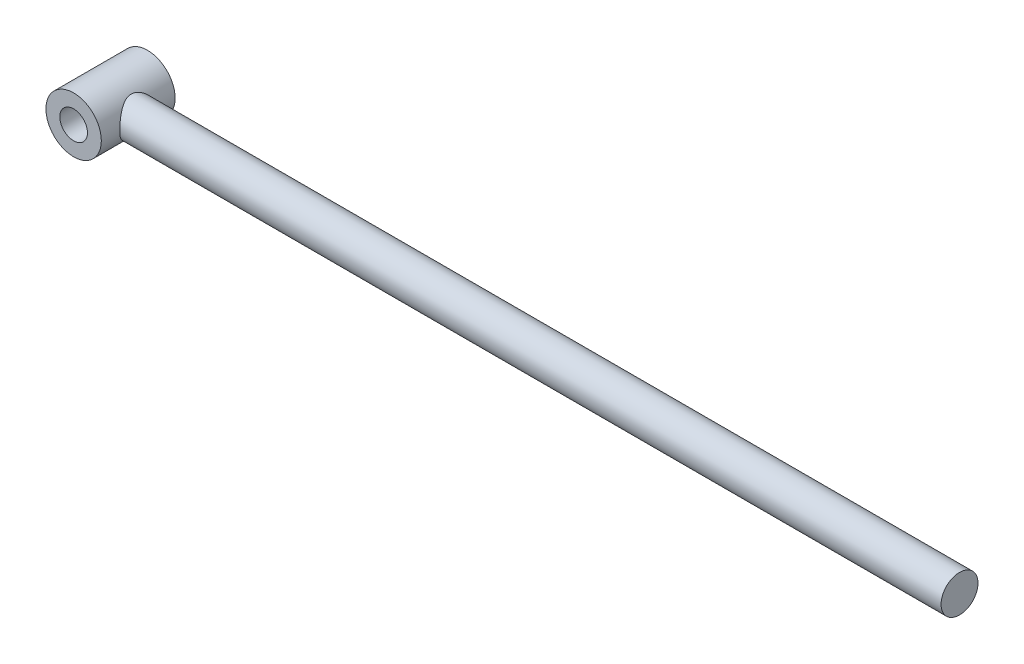
ISO-10303-21;
HEADER;
FILE_DESCRIPTION(('STEP AP214'),'2;1');
FILE_NAME('part.step','',(''),(''),'','','');
FILE_SCHEMA(('AUTOMOTIVE_DESIGN { 1 0 10303 214 1 1 1 1 }'));
ENDSEC;
DATA;
#1=APPLICATION_CONTEXT('core data for automotive mechanical design processes');
#2=APPLICATION_PROTOCOL_DEFINITION('international standard','automotive_design',2000,#1);
#3=PRODUCT_CONTEXT('',#1,'mechanical');
#4=PRODUCT('Part','Part','',(#3));
#5=PRODUCT_RELATED_PRODUCT_CATEGORY('part','',(#4));
#6=PRODUCT_DEFINITION_FORMATION('','',#4);
#7=PRODUCT_DEFINITION_CONTEXT('part definition',#1,'design');
#8=PRODUCT_DEFINITION('design','',#6,#7);
#9=PRODUCT_DEFINITION_SHAPE('','',#8);
#10=(LENGTH_UNIT() NAMED_UNIT(*) SI_UNIT(.MILLI.,.METRE.));
#11=(NAMED_UNIT(*) PLANE_ANGLE_UNIT() SI_UNIT($,.RADIAN.));
#12=(NAMED_UNIT(*) SI_UNIT($,.STERADIAN.) SOLID_ANGLE_UNIT());
#13=UNCERTAINTY_MEASURE_WITH_UNIT(LENGTH_MEASURE(1.E-05),#10,'distance_accuracy_value','');
#14=(GEOMETRIC_REPRESENTATION_CONTEXT(3) GLOBAL_UNCERTAINTY_ASSIGNED_CONTEXT((#13)) GLOBAL_UNIT_ASSIGNED_CONTEXT((#10,
#11,#12)) REPRESENTATION_CONTEXT('',''));
#15=CARTESIAN_POINT('',(0.,0.,0.));
#16=DIRECTION('',(0.,0.,1.));
#17=DIRECTION('',(1.,0.,0.));
#18=AXIS2_PLACEMENT_3D('',#15,#16,#17);
#19=CARTESIAN_POINT('',(0.,0.,40.));
#20=DIRECTION('',(0.,0.,-1.));
#21=DIRECTION('',(-1.,0.,0.));
#22=AXIS2_PLACEMENT_3D('',#19,#20,#21);
#23=CYLINDRICAL_SURFACE('',#22,30.);
#24=CARTESIAN_POINT('',(0.,0.,40.));
#25=DIRECTION('',(0.,0.,1.));
#26=DIRECTION('',(1.,0.,0.));
#27=AXIS2_PLACEMENT_3D('',#24,#25,#26);
#28=CIRCLE('',#27,30.);
#29=CARTESIAN_POINT('',(30.,0.,40.));
#30=VERTEX_POINT('',#29);
#31=EDGE_CURVE('E49',#30,#30,#28,.T.);
#32=ORIENTED_EDGE('',*,*,#31,.F.);
#33=EDGE_LOOP('',(#32));
#34=FACE_BOUND('',#33,.T.);
#35=CARTESIAN_POINT('',(0.,0.,-40.));
#36=DIRECTION('',(0.,0.,1.));
#37=DIRECTION('',(1.,0.,0.));
#38=AXIS2_PLACEMENT_3D('',#35,#36,#37);
#39=CIRCLE('',#38,30.);
#40=CARTESIAN_POINT('',(30.,0.,-40.));
#41=VERTEX_POINT('',#40);
#42=EDGE_CURVE('E54',#41,#41,#39,.T.);
#43=ORIENTED_EDGE('',*,*,#42,.T.);
#44=EDGE_LOOP('',(#43));
#45=FACE_BOUND('',#44,.T.);
#46=CARTESIAN_POINT('',(30.,0.,20.));
#47=CARTESIAN_POINT('',(29.9999998661981,-0.502432050357107,19.9999998708156));
#48=CARTESIAN_POINT('',(29.9873512767924,-1.00486659291617,19.981041890221));
#49=CARTESIAN_POINT('',(29.9370754507124,-2.00562861223446,19.9055087079442));
#50=CARTESIAN_POINT('',(29.8994480825663,-2.50395606736271,19.8489333082686));
#51=CARTESIAN_POINT('',(29.8001252135495,-3.49278874290095,19.6990002879968));
#52=CARTESIAN_POINT('',(29.7384203306489,-3.98329083644028,19.6056283291341));
#53=CARTESIAN_POINT('',(29.5924098661005,-4.9527367018995,19.3834395211629));
#54=CARTESIAN_POINT('',(29.5081040111715,-5.43168033398314,19.2546222434644));
#55=CARTESIAN_POINT('',(29.3192451350848,-6.3726831529905,18.9639204802124));
#56=CARTESIAN_POINT('',(29.2147907649452,-6.83481207132658,18.8021969068242));
#57=CARTESIAN_POINT('',(28.987567335659,-7.74207070686117,18.4471586375469));
#58=CARTESIAN_POINT('',(28.864798371266,-8.18720051199242,18.2538441050984));
#59=CARTESIAN_POINT('',(28.6033482003015,-9.05844037609498,17.8375381124749));
#60=CARTESIAN_POINT('',(28.4646675126729,-9.48455105472426,17.6145476201097));
#61=CARTESIAN_POINT('',(28.1739113247129,-10.3162415378409,17.1407197895657));
#62=CARTESIAN_POINT('',(28.0218342454824,-10.7218189133778,16.88987916806));
#63=CARTESIAN_POINT('',(27.6935578417576,-11.544666651525,16.3397046695659));
#64=CARTESIAN_POINT('',(27.5164065024113,-11.9600134544702,16.0380625153589));
#65=CARTESIAN_POINT('',(27.1528656210948,-12.7638755092378,15.4060039283267));
#66=CARTESIAN_POINT('',(26.9664756598522,-13.1523895414017,15.0755861890756));
#67=CARTESIAN_POINT('',(26.5877396332004,-13.9021114634373,14.3871695519229));
#68=CARTESIAN_POINT('',(26.3953859507486,-14.2632822184454,14.0291344326562));
#69=CARTESIAN_POINT('',(26.0086530551827,-14.9568597365416,13.2872215493219));
#70=CARTESIAN_POINT('',(25.8142737230126,-15.2892647981446,12.9033422589614));
#71=CARTESIAN_POINT('',(25.396836648899,-15.9745417178036,12.0482275933553));
#72=CARTESIAN_POINT('',(25.174096536266,-16.3223586443349,11.5727693191127));
#73=CARTESIAN_POINT('',(24.7376939344548,-16.9764877633748,10.5899657994356));
#74=CARTESIAN_POINT('',(24.5240335140448,-17.2827905315006,10.0826133516483));
#75=CARTESIAN_POINT('',(24.1134541975624,-17.8511644026812,9.03819236671138));
#76=CARTESIAN_POINT('',(23.9165127661255,-18.1132955295477,8.50116549380746));
#77=CARTESIAN_POINT('',(23.5472211433069,-18.5908454263022,7.39870988362545));
#78=CARTESIAN_POINT('',(23.3748591544978,-18.8062866319954,6.83329494920044));
#79=CARTESIAN_POINT('',(23.1083554699939,-19.13202887715,5.84404921175392));
#80=CARTESIAN_POINT('',(23.0059988256492,-19.254726201792,5.42648017350507));
#81=CARTESIAN_POINT('',(22.8211903176783,-19.4734126020971,4.58008091505703));
#82=CARTESIAN_POINT('',(22.7387352052499,-19.5694060373963,4.15125254556424));
#83=CARTESIAN_POINT('',(22.5966842761104,-19.7332623242764,3.28516192271634));
#84=CARTESIAN_POINT('',(22.5370547106277,-19.8011667190628,2.84791313270976));
#85=CARTESIAN_POINT('',(22.442775186748,-19.9079619855319,1.96717747103349));
#86=CARTESIAN_POINT('',(22.4081253652476,-19.9468526982109,1.5236905651906));
#87=CARTESIAN_POINT('',(22.3651578047493,-19.995018995311,0.631973802665962));
#88=CARTESIAN_POINT('',(22.3569497015249,-20.0041712760879,0.183731910267435));
#89=CARTESIAN_POINT('',(22.3675301691013,-19.9923398271623,-0.712030658740458));
#90=CARTESIAN_POINT('',(22.3863188316053,-19.971355995093,-1.15955133289481));
#91=CARTESIAN_POINT('',(22.4501086857203,-19.8996205096492,-2.050625095392));
#92=CARTESIAN_POINT('',(22.4951293541334,-19.8488467375743,-2.49417498677212));
#93=CARTESIAN_POINT('',(22.6095581655225,-19.7184018881212,-3.37377492739303));
#94=CARTESIAN_POINT('',(22.6789667736164,-19.6387302596127,-3.80982483343045));
#95=CARTESIAN_POINT('',(22.8360020403641,-19.4558684710411,-4.65260599507371));
#96=CARTESIAN_POINT('',(22.9226794986437,-19.3538839737256,-5.05977803330656));
#97=CARTESIAN_POINT('',(23.1133089528256,-19.1258219416928,-5.86323587316174));
#98=CARTESIAN_POINT('',(23.2172676308142,-18.9997350845369,-6.25951739443491));
#99=CARTESIAN_POINT('',(23.5509005263236,-18.5870898788947,-7.42993067111853));
#100=CARTESIAN_POINT('',(23.8024209013306,-18.2660472919538,-8.18608179416508));
#101=CARTESIAN_POINT('',(24.2342569329526,-17.6854431992285,-9.35228726673066));
#102=CARTESIAN_POINT('',(24.403077317783,-17.4522559964646,-9.78032481496439));
#103=CARTESIAN_POINT('',(24.7497432705651,-16.9570483876589,-10.6157476442302));
#104=CARTESIAN_POINT('',(24.9275896995493,-16.6950252280375,-11.023130947529));
#105=CARTESIAN_POINT('',(25.2885468949722,-16.1430567151301,-11.8167546644321));
#106=CARTESIAN_POINT('',(25.471663237886,-15.8530809594392,-12.2029713238621));
#107=CARTESIAN_POINT('',(25.8393965051977,-15.246358714758,-12.9530389311317));
#108=CARTESIAN_POINT('',(26.024013528533,-14.9296104475491,-13.3168883905748));
#109=CARTESIAN_POINT('',(26.4310497738324,-14.1989483888887,-14.097303197129));
#110=CARTESIAN_POINT('',(26.6530303956695,-13.7788159652825,-14.5083033678111));
#111=CARTESIAN_POINT('',(27.0885965336176,-12.9014676729698,-15.2937513429522));
#112=CARTESIAN_POINT('',(27.3021805000215,-12.4442450060576,-15.6681924187186));
#113=CARTESIAN_POINT('',(27.7153401348638,-11.4946861176089,-16.3775183221479));
#114=CARTESIAN_POINT('',(27.9149260225621,-11.0023760522687,-16.7124321311584));
#115=CARTESIAN_POINT('',(28.2949676279155,-9.98447354240779,-17.3397652164747));
#116=CARTESIAN_POINT('',(28.4754286055529,-9.45889031296221,-17.6321961852127));
#117=CARTESIAN_POINT('',(28.7791644068812,-8.4833461227497,-18.1181905483136));
#118=CARTESIAN_POINT('',(28.9067147978732,-8.03875717640116,-18.3198975753372));
#119=CARTESIAN_POINT('',(29.1437173052015,-7.13185034835575,-18.691623162803));
#120=CARTESIAN_POINT('',(29.2531715370476,-6.66953454679109,-18.8616454276103));
#121=CARTESIAN_POINT('',(29.4516277514227,-5.7299227277189,-19.1679937956703));
#122=CARTESIAN_POINT('',(29.5406434674396,-5.25263701566193,-19.3043425302522));
#123=CARTESIAN_POINT('',(29.6963305492252,-4.28575432400347,-19.5417523912564));
#124=CARTESIAN_POINT('',(29.7630015712691,-3.79615715514135,-19.6428129748477));
#125=CARTESIAN_POINT('',(29.872657894971,-2.80597314349125,-19.8085733139663));
#126=CARTESIAN_POINT('',(29.9155383206477,-2.30534759903096,-19.8731120951364));
#127=CARTESIAN_POINT('',(29.9760956021539,-1.29911991465958,-19.9641545523483));
#128=CARTESIAN_POINT('',(29.9937724250504,-0.793517768246534,-19.9906581786905));
#129=CARTESIAN_POINT('',(30.0034717951189,0.218464736427053,-20.0052080328604));
#130=CARTESIAN_POINT('',(29.9954953996663,0.724845061752678,-19.9932558457617));
#131=CARTESIAN_POINT('',(29.9540933231667,1.73418156784465,-19.931087455494));
#132=CARTESIAN_POINT('',(29.9206687283027,2.23713789383013,-19.8808728854445));
#133=CARTESIAN_POINT('',(29.8324414506934,3.20042176411033,-19.7478312691314));
#134=CARTESIAN_POINT('',(29.7793090042603,3.66125811656818,-19.6675483452082));
#135=CARTESIAN_POINT('',(29.6529106481444,4.57350157570509,-19.4756341111471));
#136=CARTESIAN_POINT('',(29.5796458717002,5.02490921158323,-19.3640045654864));
#137=CARTESIAN_POINT('',(29.4144446665676,5.91571607198156,-19.1106977521881));
#138=CARTESIAN_POINT('',(29.3225070223762,6.35511451265425,-18.9690185284518));
#139=CARTESIAN_POINT('',(29.1217004947068,7.21966385402625,-18.6571079304231));
#140=CARTESIAN_POINT('',(29.0128307093883,7.64481399436505,-18.486875035266));
#141=CARTESIAN_POINT('',(28.7730488442419,8.50426678457443,-18.1083152340667));
#142=CARTESIAN_POINT('',(28.641201691667,8.93756698372232,-17.8983067263232));
#143=CARTESIAN_POINT('',(28.3631030211141,9.78432512725706,-17.449829798643));
#144=CARTESIAN_POINT('',(28.2168510697156,10.1977824740429,-17.2113605223154));
#145=CARTESIAN_POINT('',(27.9124418593605,11.0036909497809,-16.7076242018634));
#146=CARTESIAN_POINT('',(27.7542793038351,11.3961325988641,-16.4423452174859));
#147=CARTESIAN_POINT('',(27.4287361682711,12.1587990167243,-15.8866695617355));
#148=CARTESIAN_POINT('',(27.2613545613898,12.5290213010131,-15.5962700903114));
#149=CARTESIAN_POINT('',(26.8930879740092,13.3031347178692,-14.9439528947196));
#150=CARTESIAN_POINT('',(26.6910905163229,13.7030923841241,-14.5779874749765));
#151=CARTESIAN_POINT('',(26.2826982946006,14.4709683638239,-13.8160664974289));
#152=CARTESIAN_POINT('',(26.0763029510259,14.8388824217615,-13.4201069693141));
#153=CARTESIAN_POINT('',(25.6635739697582,15.5417880165119,-12.5994023240134));
#154=CARTESIAN_POINT('',(25.4572404691787,15.876757023597,-12.174637839138));
#155=CARTESIAN_POINT('',(25.0497261492331,16.5122275702686,-11.2977646153286));
#156=CARTESIAN_POINT('',(24.8485448051984,16.81273263041,-10.8456586765927));
#157=CARTESIAN_POINT('',(24.4733023029991,17.3538627139578,-9.95448274755281));
#158=CARTESIAN_POINT('',(24.2983863656877,17.5974024349064,-9.51754297050518));
#159=CARTESIAN_POINT('',(23.9619407246742,18.0528546349536,-8.62244520074572));
#160=CARTESIAN_POINT('',(23.8004112149102,18.2647666558762,-8.16428690077693));
#161=CARTESIAN_POINT('',(23.4959190621918,18.6548371117046,-7.22866142786252));
#162=CARTESIAN_POINT('',(23.352929353255,18.8330449293941,-6.75122376801286));
#163=CARTESIAN_POINT('',(23.0904591353035,19.1539484457238,-5.77827480129949));
#164=CARTESIAN_POINT('',(22.9709732247938,19.2966523056608,-5.28276767814733));
#165=CARTESIAN_POINT('',(22.7795445121487,19.5220414226083,-4.36698264384053));
#166=CARTESIAN_POINT('',(22.7029160837044,19.6109049179647,-3.94920001271946));
#167=CARTESIAN_POINT('',(22.5714513943609,19.7620762933325,-3.1054686934564));
#168=CARTESIAN_POINT('',(22.5166125085731,19.82438737206,-2.6795209954077));
#169=CARTESIAN_POINT('',(22.4307802243878,19.9214537495162,-1.8224911908299));
#170=CARTESIAN_POINT('',(22.3997648547817,19.9562344390175,-1.39141418836717));
#171=CARTESIAN_POINT('',(22.3627151772862,19.9977438544737,-0.526818989046352));
#172=CARTESIAN_POINT('',(22.3566812339737,20.0044721710347,-0.093300756653625));
#173=CARTESIAN_POINT('',(22.3698449862022,19.9897505651309,0.773115287328889));
#174=CARTESIAN_POINT('',(22.3890570855061,19.9682845568072,1.20601260355544));
#175=CARTESIAN_POINT('',(22.4519644396444,19.89752521375,2.06770261584204));
#176=CARTESIAN_POINT('',(22.4956594937704,19.8482321071399,2.49649534552171));
#177=CARTESIAN_POINT('',(22.6059284972836,19.7225495457303,3.34758196945676));
#178=CARTESIAN_POINT('',(22.672528474229,19.6461292623078,3.76986789699179));
#179=CARTESIAN_POINT('',(22.8262602119977,19.4672984586528,4.60508117377623));
#180=CARTESIAN_POINT('',(22.9133946099072,19.3648846001243,5.01800731354381));
#181=CARTESIAN_POINT('',(23.1310818906606,19.1046848410163,5.94123169432083));
#182=CARTESIAN_POINT('',(23.2670175183132,18.9394160062732,6.44816076864198));
#183=CARTESIAN_POINT('',(23.5616278122302,18.5716220555323,7.44147650640459));
#184=CARTESIAN_POINT('',(23.7203087439171,18.3690866697139,7.92785746170607));
#185=CARTESIAN_POINT('',(24.0548494900776,17.928768029319,8.87885978411792));
#186=CARTESIAN_POINT('',(24.230727597647,17.6909470983741,9.34345718517344));
#187=CARTESIAN_POINT('',(24.5941802563021,17.1820850766219,10.2491849776676));
#188=CARTESIAN_POINT('',(24.781754189423,16.9110457402246,10.6903166066737));
#189=CARTESIAN_POINT('',(25.1672255632098,16.3319905343255,11.5560455039427));
#190=CARTESIAN_POINT('',(25.3652486390898,16.0233924051234,11.9801968484712));
#191=CARTESIAN_POINT('',(25.7637225763061,15.3745104302451,12.8022908705141));
#192=CARTESIAN_POINT('',(25.9641734317233,15.0342266618099,13.200233611914));
#193=CARTESIAN_POINT('',(26.3632502502894,14.3228973596636,13.9688530344093));
#194=CARTESIAN_POINT('',(26.5618756733661,13.951843028237,14.33952185996));
#195=CARTESIAN_POINT('',(26.9531887772778,13.180017889376,15.0520096270216));
#196=CARTESIAN_POINT('',(27.1458759630328,12.779244613665,15.3938261671826));
#197=CARTESIAN_POINT('',(27.5484327444244,11.8892953412499,16.0937728405199));
#198=CARTESIAN_POINT('',(27.7567878541469,11.3956949938791,16.4471788212645));
#199=CARTESIAN_POINT('',(28.1549839321458,10.372947033489,17.1106254017982));
#200=CARTESIAN_POINT('',(28.3448221999976,9.84379425458726,17.42065967928));
#201=CARTESIAN_POINT('',(28.7002669540513,8.7534583378163,17.9932104380746));
#202=CARTESIAN_POINT('',(28.8659031307225,8.19231563994947,18.2557852367735));
#203=CARTESIAN_POINT('',(29.1680076078479,7.04137086874954,18.7298173077689));
#204=CARTESIAN_POINT('',(29.3044861493112,6.45157894748342,18.9412925311521));
#205=CARTESIAN_POINT('',(29.5171038312658,5.38222751658728,19.2683981125324));
#206=CARTESIAN_POINT('',(29.5999120726272,4.90728446450014,19.3948839484347));
#207=CARTESIAN_POINT('',(29.7432935523992,3.94618639128292,19.6130133782002));
#208=CARTESIAN_POINT('',(29.8038703786017,3.46003319276103,19.7046625942176));
#209=CARTESIAN_POINT('',(29.9013488891663,2.48023551916962,19.8517933612465));
#210=CARTESIAN_POINT('',(29.9382651667603,1.98659585428405,19.9072972061548));
#211=CARTESIAN_POINT('',(29.9875912480541,0.995305041117371,19.9814012816267));
#212=CARTESIAN_POINT('',(30.0000001325294,0.497653743070644,20.0000001279558));
#213=CARTESIAN_POINT('',(30.,0.,20.));
#214=B_SPLINE_CURVE_WITH_KNOTS('',3,(#46,#47,#48,#49,#50,#51,#52,#53,#54,#55,#56,#57,#58,#59,
#60,#61,#62,#63,#64,#65,#66,#67,#68,#69,#70,#71,#72,#73,#74,#75,#76,#77,#78,#79,#80,#81,#82,#83,
#84,#85,#86,#87,#88,#89,#90,#91,#92,#93,#94,#95,#96,#97,#98,#99,#100,#101,#102,#103,#104,#105,
#106,#107,#108,#109,#110,#111,#112,#113,#114,#115,#116,#117,#118,#119,#120,#121,#122,#123,#124,
#125,#126,#127,#128,#129,#130,#131,#132,#133,#134,#135,#136,#137,#138,#139,#140,#141,#142,#143,
#144,#145,#146,#147,#148,#149,#150,#151,#152,#153,#154,#155,#156,#157,#158,#159,#160,#161,#162,
#163,#164,#165,#166,#167,#168,#169,#170,#171,#172,#173,#174,#175,#176,#177,#178,#179,#180,#181,
#182,#183,#184,#185,#186,#187,#188,#189,#190,#191,#192,#193,#194,#195,#196,#197,#198,#199,#200,
#201,#202,#203,#204,#205,#206,#207,#208,#209,#210,#211,#212,#213),.UNSPECIFIED.,.T.,.F.,(4,2,2,
2,2,2,2,2,2,2,2,2,2,2,2,2,2,2,2,2,2,2,2,2,2,2,2,2,2,2,2,2,2,2,2,2,2,2,2,2,2,2,2,2,2,2,2,2,2,2,2,
2,2,2,2,2,2,2,2,2,2,2,2,2,2,2,2,2,2,2,2,2,2,2,2,2,2,2,2,2,2,2,2,4),(0.,1.50678860030269,
3.01358513141216,4.52096938721657,6.02837187047945,7.52857302893605,9.02876642612416,
10.5289109101103,12.0292324383504,13.6567444840869,15.284330458243,16.9140886133164,
18.5439431024577,20.431131930561,22.3187484658921,24.2037789087041,26.0879015235946,
27.4279650999174,28.7678097709498,30.1056656880386,31.4435289369311,32.7869323000986,
34.1303402265693,35.4747468830929,36.8191791810432,38.1037263431644,39.3887713582513,
41.9574635192448,43.5039572638651,45.0505988133526,46.5989419535985,48.1473880150574,
50.0299431140749,51.9128440463346,53.7943557465543,55.6753486185392,57.1876211138398,
58.6997166935429,60.2107932404063,61.7218930308516,63.2396023156496,64.7573135836025,
66.2749622952646,67.7925462340977,69.2033177886316,70.6140099478306,72.0247939649324,
73.4356531490233,74.9318700392892,76.4281319624119,77.9250632379934,79.4221615843148,
81.1559974776003,82.8900632805819,84.6253068106235,86.3603729242013,87.9487273830719,
89.5371048494666,91.1231367124568,92.7088036566569,94.0093258243475,95.3096912764256,
96.6088560233589,97.9080397301251,99.2079649891922,100.507879591774,101.809276234171,
103.110840096639,104.759184673476,106.407984179069,108.058557042328,109.70904276911,
111.389510486189,113.069974106853,114.750919862111,116.432005383304,118.354868197109,
120.278011015838,122.198774401875,124.118862046836,125.61242765333,127.105752116314,
128.598154645697,130.090613151129),.UNSPECIFIED.);
#215=CARTESIAN_POINT('',(30.,0.,20.));
#216=VERTEX_POINT('',#215);
#217=EDGE_CURVE('E10',#216,#216,#214,.T.);
#218=ORIENTED_EDGE('',*,*,#217,.F.);
#219=EDGE_LOOP('',(#218));
#220=FACE_BOUND('',#219,.T.);
#221=ADVANCED_FACE('F37',(#34,#45,#220),#23,.T.);
#222=CARTESIAN_POINT('',(0.,0.,40.));
#223=DIRECTION('',(0.,0.,1.));
#224=DIRECTION('',(1.,0.,0.));
#225=AXIS2_PLACEMENT_3D('',#222,#223,#224);
#226=PLANE('',#225);
#227=ORIENTED_EDGE('',*,*,#31,.T.);
#228=EDGE_LOOP('',(#227));
#229=FACE_BOUND('',#228,.T.);
#230=CARTESIAN_POINT('',(0.,0.,40.));
#231=DIRECTION('',(0.,0.,1.));
#232=DIRECTION('',(1.,0.,0.));
#233=AXIS2_PLACEMENT_3D('',#230,#231,#232);
#234=CIRCLE('',#233,15.);
#235=CARTESIAN_POINT('',(15.,0.,40.));
#236=VERTEX_POINT('',#235);
#237=EDGE_CURVE('E60',#236,#236,#234,.T.);
#238=ORIENTED_EDGE('',*,*,#237,.F.);
#239=EDGE_LOOP('',(#238));
#240=FACE_BOUND('',#239,.T.);
#241=ADVANCED_FACE('F89',(#229,#240),#226,.T.);
#242=CARTESIAN_POINT('',(0.,0.,-40.));
#243=DIRECTION('',(0.,0.,1.));
#244=DIRECTION('',(1.,0.,0.));
#245=AXIS2_PLACEMENT_3D('',#242,#243,#244);
#246=PLANE('',#245);
#247=ORIENTED_EDGE('',*,*,#42,.F.);
#248=EDGE_LOOP('',(#247));
#249=FACE_BOUND('',#248,.T.);
#250=CARTESIAN_POINT('',(0.,0.,-40.));
#251=DIRECTION('',(0.,0.,1.));
#252=DIRECTION('',(1.,0.,0.));
#253=AXIS2_PLACEMENT_3D('',#250,#251,#252);
#254=CIRCLE('',#253,15.);
#255=CARTESIAN_POINT('',(15.,0.,-40.));
#256=VERTEX_POINT('',#255);
#257=EDGE_CURVE('E62',#256,#256,#254,.T.);
#258=ORIENTED_EDGE('',*,*,#257,.T.);
#259=EDGE_LOOP('',(#258));
#260=FACE_BOUND('',#259,.T.);
#261=ADVANCED_FACE('F84',(#249,#260),#246,.F.);
#262=CARTESIAN_POINT('',(0.,0.,40.));
#263=DIRECTION('',(0.,0.,-1.));
#264=DIRECTION('',(-1.,0.,0.));
#265=AXIS2_PLACEMENT_3D('',#262,#263,#264);
#266=CYLINDRICAL_SURFACE('',#265,15.);
#267=ORIENTED_EDGE('',*,*,#237,.T.);
#268=EDGE_LOOP('',(#267));
#269=FACE_BOUND('',#268,.T.);
#270=ORIENTED_EDGE('',*,*,#257,.F.);
#271=EDGE_LOOP('',(#270));
#272=FACE_BOUND('',#271,.T.);
#273=ADVANCED_FACE('F78',(#269,#272),#266,.F.);
#274=CARTESIAN_POINT('',(920.,0.,0.));
#275=DIRECTION('',(-1.,0.,0.));
#276=DIRECTION('',(0.,0.,1.));
#277=AXIS2_PLACEMENT_3D('',#274,#275,#276);
#278=CYLINDRICAL_SURFACE('',#277,20.);
#279=CARTESIAN_POINT('',(920.,0.,0.));
#280=DIRECTION('',(1.,0.,0.));
#281=DIRECTION('',(0.,0.,-1.));
#282=AXIS2_PLACEMENT_3D('',#279,#280,#281);
#283=CIRCLE('',#282,20.);
#284=CARTESIAN_POINT('',(920.,0.,-20.));
#285=VERTEX_POINT('',#284);
#286=EDGE_CURVE('E66',#285,#285,#283,.T.);
#287=ORIENTED_EDGE('',*,*,#286,.F.);
#288=EDGE_LOOP('',(#287));
#289=FACE_BOUND('',#288,.T.);
#290=ORIENTED_EDGE('',*,*,#217,.T.);
#291=EDGE_LOOP('',(#290));
#292=FACE_BOUND('',#291,.T.);
#293=ADVANCED_FACE('F76',(#289,#292),#278,.T.);
#294=CARTESIAN_POINT('',(920.,0.,0.));
#295=DIRECTION('',(1.,0.,0.));
#296=DIRECTION('',(0.,0.,-1.));
#297=AXIS2_PLACEMENT_3D('',#294,#295,#296);
#298=PLANE('',#297);
#299=ORIENTED_EDGE('',*,*,#286,.T.);
#300=EDGE_LOOP('',(#299));
#301=FACE_BOUND('',#300,.T.);
#302=ADVANCED_FACE('F74',(#301),#298,.T.);
#303=CLOSED_SHELL('',(#221,#241,#261,#273,#293,#302));
#304=MANIFOLD_SOLID_BREP('B2',#303);
#305=ADVANCED_BREP_SHAPE_REPRESENTATION('',(#18,#304),#14);
#306=SHAPE_DEFINITION_REPRESENTATION(#9,#305);
ENDSEC;
END-ISO-10303-21;
